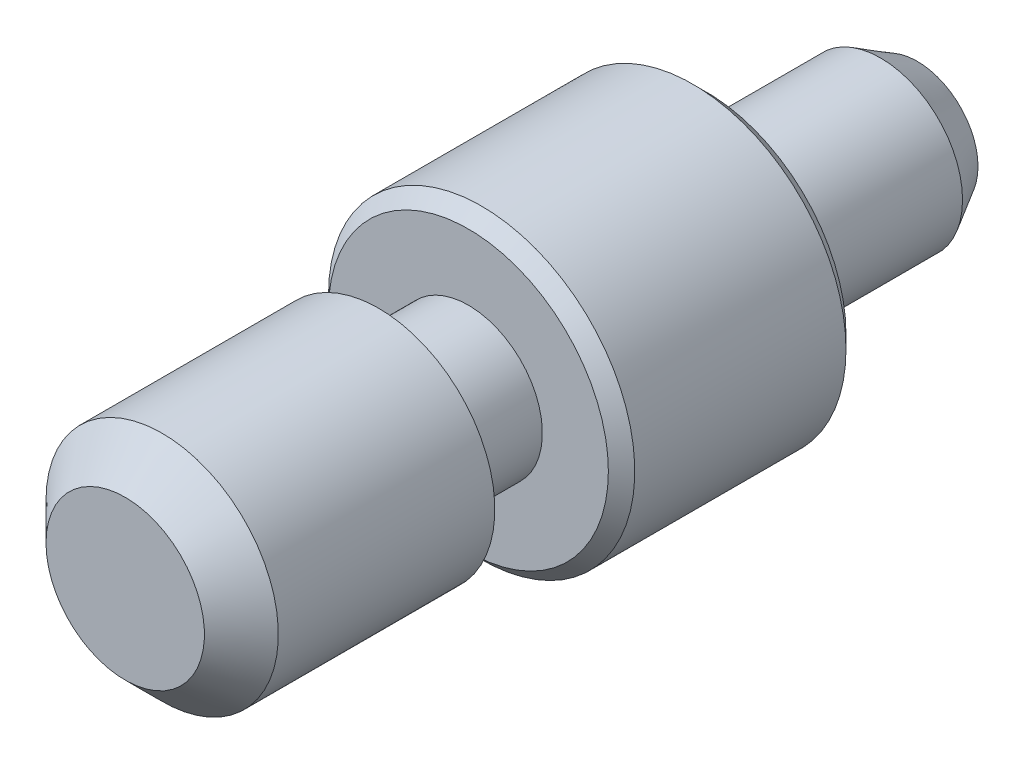
ISO-10303-21;
HEADER;
FILE_DESCRIPTION(('STEP AP214'),'2;1');
FILE_NAME('part.step','',(''),(''),'','','');
FILE_SCHEMA(('AUTOMOTIVE_DESIGN { 1 0 10303 214 1 1 1 1 }'));
ENDSEC;
DATA;
#1=APPLICATION_CONTEXT('core data for automotive mechanical design processes');
#2=APPLICATION_PROTOCOL_DEFINITION('international standard','automotive_design',2000,#1);
#3=PRODUCT_CONTEXT('',#1,'mechanical');
#4=PRODUCT('Part','Part','',(#3));
#5=PRODUCT_RELATED_PRODUCT_CATEGORY('part','',(#4));
#6=PRODUCT_DEFINITION_FORMATION('','',#4);
#7=PRODUCT_DEFINITION_CONTEXT('part definition',#1,'design');
#8=PRODUCT_DEFINITION('design','',#6,#7);
#9=PRODUCT_DEFINITION_SHAPE('','',#8);
#10=(LENGTH_UNIT() NAMED_UNIT(*) SI_UNIT(.MILLI.,.METRE.));
#11=(NAMED_UNIT(*) PLANE_ANGLE_UNIT() SI_UNIT($,.RADIAN.));
#12=(NAMED_UNIT(*) SI_UNIT($,.STERADIAN.) SOLID_ANGLE_UNIT());
#13=UNCERTAINTY_MEASURE_WITH_UNIT(LENGTH_MEASURE(1.E-05),#10,'distance_accuracy_value','');
#14=(GEOMETRIC_REPRESENTATION_CONTEXT(3) GLOBAL_UNCERTAINTY_ASSIGNED_CONTEXT((#13)) GLOBAL_UNIT_ASSIGNED_CONTEXT((#10,
#11,#12)) REPRESENTATION_CONTEXT('',''));
#15=CARTESIAN_POINT('',(0.,0.,0.));
#16=DIRECTION('',(0.,0.,1.));
#17=DIRECTION('',(1.,0.,0.));
#18=AXIS2_PLACEMENT_3D('',#15,#16,#17);
#19=CARTESIAN_POINT('',(0.,1.1176,22.4028025298864));
#20=DIRECTION('',(0.,0.,1.));
#21=DIRECTION('',(1.,0.,0.));
#22=AXIS2_PLACEMENT_3D('',#19,#20,#21);
#23=PLANE('',#22);
#24=CARTESIAN_POINT('',(0.,0.,22.4028025298821));
#25=DIRECTION('',(0.,0.,-1.));
#26=DIRECTION('',(-1.,0.,0.));
#27=AXIS2_PLACEMENT_3D('',#24,#25,#26);
#28=CIRCLE('',#27,0.762000000065655);
#29=CARTESIAN_POINT('',(-0.762000000065655,0.,22.4028025298821));
#30=VERTEX_POINT('',#29);
#31=EDGE_CURVE('E17',#30,#30,#28,.T.);
#32=ORIENTED_EDGE('',*,*,#31,.F.);
#33=EDGE_LOOP('',(#32));
#34=FACE_BOUND('',#33,.T.);
#35=ADVANCED_FACE('F14',(#34),#23,.T.);
#36=CARTESIAN_POINT('',(0.,0.,22.0472025300182));
#37=DIRECTION('',(0.,0.,-1.));
#38=DIRECTION('',(-1.,0.,0.));
#39=AXIS2_PLACEMENT_3D('',#36,#37,#38);
#40=CONICAL_SURFACE('',#39,1.11759999992955,0.785398163397448);
#41=ORIENTED_EDGE('',*,*,#31,.T.);
#42=EDGE_LOOP('',(#41));
#43=FACE_BOUND('',#42,.T.);
#44=CARTESIAN_POINT('',(0.,0.,22.0472025298864));
#45=DIRECTION('',(0.,0.,-1.));
#46=DIRECTION('',(-1.,0.,0.));
#47=AXIS2_PLACEMENT_3D('',#44,#45,#46);
#48=CIRCLE('',#47,1.1176);
#49=CARTESIAN_POINT('',(-1.1176,0.,22.0472025298864));
#50=VERTEX_POINT('',#49);
#51=EDGE_CURVE('E40',#50,#50,#48,.T.);
#52=ORIENTED_EDGE('',*,*,#51,.F.);
#53=EDGE_LOOP('',(#52));
#54=FACE_BOUND('',#53,.T.);
#55=ADVANCED_FACE('F68',(#43,#54),#40,.T.);
#56=CARTESIAN_POINT('',(0.,0.,14.7828025298864));
#57=DIRECTION('',(0.,0.,-1.));
#58=DIRECTION('',(-1.,0.,0.));
#59=AXIS2_PLACEMENT_3D('',#56,#57,#58);
#60=PLANE('',#59);
#61=CARTESIAN_POINT('',(0.,0.,14.7828025299077));
#62=DIRECTION('',(0.,0.,1.));
#63=DIRECTION('',(1.,0.,0.));
#64=AXIS2_PLACEMENT_3D('',#61,#62,#63);
#65=CIRCLE('',#64,0.584199999991597);
#66=CARTESIAN_POINT('',(0.584199999991597,0.,14.7828025299077));
#67=VERTEX_POINT('',#66);
#68=EDGE_CURVE('E43',#67,#67,#65,.T.);
#69=ORIENTED_EDGE('',*,*,#68,.F.);
#70=EDGE_LOOP('',(#69));
#71=FACE_BOUND('',#70,.T.);
#72=ADVANCED_FACE('F65',(#71),#60,.T.);
#73=CARTESIAN_POINT('',(0.,0.,21.1836025298864));
#74=DIRECTION('',(0.,0.,-1.));
#75=DIRECTION('',(-1.,0.,0.));
#76=AXIS2_PLACEMENT_3D('',#73,#74,#75);
#77=CYLINDRICAL_SURFACE('',#76,1.1176);
#78=ORIENTED_EDGE('',*,*,#51,.T.);
#79=EDGE_LOOP('',(#78));
#80=FACE_BOUND('',#79,.T.);
#81=CARTESIAN_POINT('',(0.,0.,19.9644025298864));
#82=DIRECTION('',(0.,0.,-1.));
#83=DIRECTION('',(-1.,0.,0.));
#84=AXIS2_PLACEMENT_3D('',#81,#82,#83);
#85=CIRCLE('',#84,1.1176);
#86=CARTESIAN_POINT('',(-1.1176,0.,19.9644025298864));
#87=VERTEX_POINT('',#86);
#88=EDGE_CURVE('E37',#87,#87,#85,.T.);
#89=ORIENTED_EDGE('',*,*,#88,.F.);
#90=EDGE_LOOP('',(#89));
#91=FACE_BOUND('',#90,.T.);
#92=ADVANCED_FACE('F67',(#80,#91),#77,.T.);
#93=CARTESIAN_POINT('',(0.,0.,15.1347552539391));
#94=DIRECTION('',(0.,0.,1.));
#95=DIRECTION('',(1.,0.,0.));
#96=AXIS2_PLACEMENT_3D('',#93,#94,#95);
#97=CONICAL_SURFACE('',#96,0.787399999978788,0.523598775652895);
#98=CARTESIAN_POINT('',(0.,0.,15.1347552539847));
#99=DIRECTION('',(0.,0.,-1.));
#100=DIRECTION('',(-1.,0.,0.));
#101=AXIS2_PLACEMENT_3D('',#98,#99,#100);
#102=CIRCLE('',#101,0.787400000000188);
#103=CARTESIAN_POINT('',(-0.787400000000188,0.,15.1347552539847));
#104=VERTEX_POINT('',#103);
#105=EDGE_CURVE('E33',#104,#104,#102,.F.);
#106=ORIENTED_EDGE('',*,*,#105,.F.);
#107=EDGE_LOOP('',(#106));
#108=FACE_BOUND('',#107,.T.);
#109=ORIENTED_EDGE('',*,*,#68,.T.);
#110=EDGE_LOOP('',(#109));
#111=FACE_BOUND('',#110,.T.);
#112=ADVANCED_FACE('F63',(#108,#111),#97,.T.);
#113=CARTESIAN_POINT('',(0.,0.7112,19.9644025298864));
#114=DIRECTION('',(0.,0.,-1.));
#115=DIRECTION('',(-1.,0.,0.));
#116=AXIS2_PLACEMENT_3D('',#113,#114,#115);
#117=PLANE('',#116);
#118=CARTESIAN_POINT('',(0.,0.,19.9644025298864));
#119=DIRECTION('',(0.,0.,-1.));
#120=DIRECTION('',(-1.,0.,0.));
#121=AXIS2_PLACEMENT_3D('',#118,#119,#120);
#122=CIRCLE('',#121,0.7112);
#123=CARTESIAN_POINT('',(-0.7112,0.,19.9644025298864));
#124=VERTEX_POINT('',#123);
#125=EDGE_CURVE('E36',#124,#124,#122,.T.);
#126=ORIENTED_EDGE('',*,*,#125,.F.);
#127=EDGE_LOOP('',(#126));
#128=FACE_BOUND('',#127,.T.);
#129=ORIENTED_EDGE('',*,*,#88,.T.);
#130=EDGE_LOOP('',(#129));
#131=FACE_BOUND('',#130,.T.);
#132=ADVANCED_FACE('F108',(#128,#131),#117,.T.);
#133=CARTESIAN_POINT('',(0.,0.,15.9747788919356));
#134=DIRECTION('',(0.,0.,-1.));
#135=DIRECTION('',(-1.,0.,0.));
#136=AXIS2_PLACEMENT_3D('',#133,#134,#135);
#137=CYLINDRICAL_SURFACE('',#136,0.787400000000188);
#138=CARTESIAN_POINT('',(0.,0.,16.8148025298864));
#139=DIRECTION('',(0.,0.,-1.));
#140=DIRECTION('',(-1.,0.,0.));
#141=AXIS2_PLACEMENT_3D('',#138,#139,#140);
#142=CIRCLE('',#141,0.787400000000188);
#143=CARTESIAN_POINT('',(-0.787400000000188,0.,16.8148025298864));
#144=VERTEX_POINT('',#143);
#145=EDGE_CURVE('E54',#144,#144,#142,.F.);
#146=ORIENTED_EDGE('',*,*,#145,.F.);
#147=EDGE_LOOP('',(#146));
#148=FACE_BOUND('',#147,.T.);
#149=ORIENTED_EDGE('',*,*,#105,.T.);
#150=EDGE_LOOP('',(#149));
#151=FACE_BOUND('',#150,.T.);
#152=ADVANCED_FACE('F104',(#148,#151),#137,.T.);
#153=CARTESIAN_POINT('',(0.,0.,19.5326025298864));
#154=DIRECTION('',(0.,0.,-1.));
#155=DIRECTION('',(-1.,0.,0.));
#156=AXIS2_PLACEMENT_3D('',#153,#154,#155);
#157=CYLINDRICAL_SURFACE('',#156,0.7112);
#158=ORIENTED_EDGE('',*,*,#125,.T.);
#159=EDGE_LOOP('',(#158));
#160=FACE_BOUND('',#159,.T.);
#161=CARTESIAN_POINT('',(0.,0.,19.1008025298864));
#162=DIRECTION('',(0.,0.,-1.));
#163=DIRECTION('',(-1.,0.,0.));
#164=AXIS2_PLACEMENT_3D('',#161,#162,#163);
#165=CIRCLE('',#164,0.7112);
#166=CARTESIAN_POINT('',(-0.7112,0.,19.1008025298864));
#167=VERTEX_POINT('',#166);
#168=EDGE_CURVE('E51',#167,#167,#165,.T.);
#169=ORIENTED_EDGE('',*,*,#168,.F.);
#170=EDGE_LOOP('',(#169));
#171=FACE_BOUND('',#170,.T.);
#172=ADVANCED_FACE('F100',(#160,#171),#157,.T.);
#173=CARTESIAN_POINT('',(0.,0.787400000000188,16.8148025298864));
#174=DIRECTION('',(0.,0.,-1.));
#175=DIRECTION('',(-1.,0.,0.));
#176=AXIS2_PLACEMENT_3D('',#173,#174,#175);
#177=PLANE('',#176);
#178=ORIENTED_EDGE('',*,*,#145,.T.);
#179=EDGE_LOOP('',(#178));
#180=FACE_BOUND('',#179,.T.);
#181=CARTESIAN_POINT('',(0.,0.,16.8148025298365));
#182=DIRECTION('',(0.,0.,1.));
#183=DIRECTION('',(1.,0.,0.));
#184=AXIS2_PLACEMENT_3D('',#181,#182,#183);
#185=CIRCLE('',#184,1.34619999994356);
#186=CARTESIAN_POINT('',(1.34619999994356,0.,16.8148025298365));
#187=VERTEX_POINT('',#186);
#188=EDGE_CURVE('E48',#187,#187,#185,.T.);
#189=ORIENTED_EDGE('',*,*,#188,.F.);
#190=EDGE_LOOP('',(#189));
#191=FACE_BOUND('',#190,.T.);
#192=ADVANCED_FACE('F96',(#180,#191),#177,.T.);
#193=CARTESIAN_POINT('',(0.,1.4732,19.1008025298864));
#194=DIRECTION('',(0.,0.,1.));
#195=DIRECTION('',(1.,0.,0.));
#196=AXIS2_PLACEMENT_3D('',#193,#194,#195);
#197=PLANE('',#196);
#198=ORIENTED_EDGE('',*,*,#168,.T.);
#199=EDGE_LOOP('',(#198));
#200=FACE_BOUND('',#199,.T.);
#201=CARTESIAN_POINT('',(0.,0.,19.1008025298629));
#202=DIRECTION('',(0.,0.,-1.));
#203=DIRECTION('',(-1.,0.,0.));
#204=AXIS2_PLACEMENT_3D('',#201,#202,#203);
#205=CIRCLE('',#204,1.34620000005725);
#206=CARTESIAN_POINT('',(-1.34620000005725,0.,19.1008025298629));
#207=VERTEX_POINT('',#206);
#208=EDGE_CURVE('E26',#207,#207,#205,.T.);
#209=ORIENTED_EDGE('',*,*,#208,.F.);
#210=EDGE_LOOP('',(#209));
#211=FACE_BOUND('',#210,.T.);
#212=ADVANCED_FACE('F92',(#200,#211),#197,.T.);
#213=CARTESIAN_POINT('',(0.,0.,16.9418025298569));
#214=DIRECTION('',(0.,0.,1.));
#215=DIRECTION('',(1.,0.,0.));
#216=AXIS2_PLACEMENT_3D('',#213,#214,#215);
#217=CONICAL_SURFACE('',#216,1.47319999990714,0.785398163173655);
#218=CARTESIAN_POINT('',(0.,0.,16.9418025298864));
#219=DIRECTION('',(0.,0.,-1.));
#220=DIRECTION('',(-1.,0.,0.));
#221=AXIS2_PLACEMENT_3D('',#218,#219,#220);
#222=CIRCLE('',#221,1.4732);
#223=CARTESIAN_POINT('',(-1.4732,0.,16.9418025298864));
#224=VERTEX_POINT('',#223);
#225=EDGE_CURVE('E21',#224,#224,#222,.F.);
#226=ORIENTED_EDGE('',*,*,#225,.F.);
#227=EDGE_LOOP('',(#226));
#228=FACE_BOUND('',#227,.T.);
#229=ORIENTED_EDGE('',*,*,#188,.T.);
#230=EDGE_LOOP('',(#229));
#231=FACE_BOUND('',#230,.T.);
#232=ADVANCED_FACE('F85',(#228,#231),#217,.T.);
#233=CARTESIAN_POINT('',(0.,0.,18.973802530013));
#234=DIRECTION('',(0.,0.,-1.));
#235=DIRECTION('',(-1.,0.,0.));
#236=AXIS2_PLACEMENT_3D('',#233,#234,#235);
#237=CONICAL_SURFACE('',#236,1.47319999990714,0.785398163397448);
#238=ORIENTED_EDGE('',*,*,#208,.T.);
#239=EDGE_LOOP('',(#238));
#240=FACE_BOUND('',#239,.T.);
#241=CARTESIAN_POINT('',(0.,0.,18.9738025298864));
#242=DIRECTION('',(0.,0.,-1.));
#243=DIRECTION('',(-1.,0.,0.));
#244=AXIS2_PLACEMENT_3D('',#241,#242,#243);
#245=CIRCLE('',#244,1.4732);
#246=CARTESIAN_POINT('',(-1.4732,0.,18.9738025298864));
#247=VERTEX_POINT('',#246);
#248=EDGE_CURVE('E10',#247,#247,#245,.T.);
#249=ORIENTED_EDGE('',*,*,#248,.F.);
#250=EDGE_LOOP('',(#249));
#251=FACE_BOUND('',#250,.T.);
#252=ADVANCED_FACE('F80',(#240,#251),#237,.T.);
#253=CARTESIAN_POINT('',(0.,0.,17.9578025298864));
#254=DIRECTION('',(0.,0.,-1.));
#255=DIRECTION('',(-1.,0.,0.));
#256=AXIS2_PLACEMENT_3D('',#253,#254,#255);
#257=CYLINDRICAL_SURFACE('',#256,1.4732);
#258=ORIENTED_EDGE('',*,*,#248,.T.);
#259=EDGE_LOOP('',(#258));
#260=FACE_BOUND('',#259,.T.);
#261=ORIENTED_EDGE('',*,*,#225,.T.);
#262=EDGE_LOOP('',(#261));
#263=FACE_BOUND('',#262,.T.);
#264=ADVANCED_FACE('F78',(#260,#263),#257,.T.);
#265=CLOSED_SHELL('',(#35,#55,#72,#92,#112,#132,#152,#172,#192,#212,#232,#252,#264));
#266=MANIFOLD_SOLID_BREP('B1',#265);
#267=ADVANCED_BREP_SHAPE_REPRESENTATION('',(#18,#266),#14);
#268=SHAPE_DEFINITION_REPRESENTATION(#9,#267);
ENDSEC;
END-ISO-10303-21;
